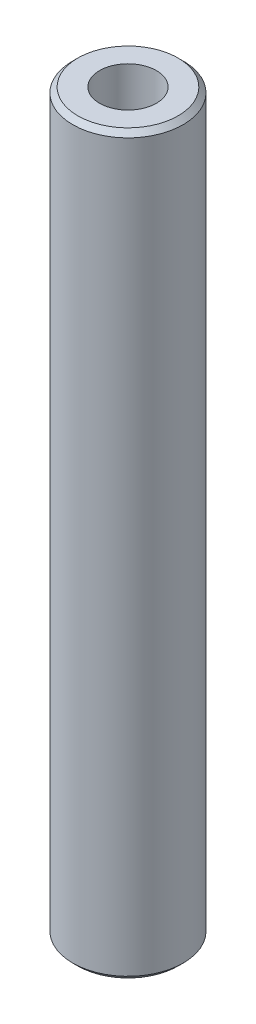
ISO-10303-21;
HEADER;
FILE_DESCRIPTION(('STEP AP214'),'2;1');
FILE_NAME('part.step','',(''),(''),'','','');
FILE_SCHEMA(('AUTOMOTIVE_DESIGN { 1 0 10303 214 1 1 1 1 }'));
ENDSEC;
DATA;
#1=APPLICATION_CONTEXT('core data for automotive mechanical design processes');
#2=APPLICATION_PROTOCOL_DEFINITION('international standard','automotive_design',2000,#1);
#3=PRODUCT_CONTEXT('',#1,'mechanical');
#4=PRODUCT('Part','Part','',(#3));
#5=PRODUCT_RELATED_PRODUCT_CATEGORY('part','',(#4));
#6=PRODUCT_DEFINITION_FORMATION('','',#4);
#7=PRODUCT_DEFINITION_CONTEXT('part definition',#1,'design');
#8=PRODUCT_DEFINITION('design','',#6,#7);
#9=PRODUCT_DEFINITION_SHAPE('','',#8);
#10=(LENGTH_UNIT() NAMED_UNIT(*) SI_UNIT(.MILLI.,.METRE.));
#11=(NAMED_UNIT(*) PLANE_ANGLE_UNIT() SI_UNIT($,.RADIAN.));
#12=(NAMED_UNIT(*) SI_UNIT($,.STERADIAN.) SOLID_ANGLE_UNIT());
#13=UNCERTAINTY_MEASURE_WITH_UNIT(LENGTH_MEASURE(1.E-05),#10,'distance_accuracy_value','');
#14=(GEOMETRIC_REPRESENTATION_CONTEXT(3) GLOBAL_UNCERTAINTY_ASSIGNED_CONTEXT((#13)) GLOBAL_UNIT_ASSIGNED_CONTEXT((#10,
#11,#12)) REPRESENTATION_CONTEXT('',''));
#15=CARTESIAN_POINT('',(0.,0.,0.));
#16=DIRECTION('',(0.,0.,1.));
#17=DIRECTION('',(1.,0.,0.));
#18=AXIS2_PLACEMENT_3D('',#15,#16,#17);
#19=CARTESIAN_POINT('',(0.,600.,0.));
#20=DIRECTION('',(0.,-1.,0.));
#21=DIRECTION('',(0.,0.,-1.));
#22=AXIS2_PLACEMENT_3D('',#19,#20,#21);
#23=CYLINDRICAL_SURFACE('',#22,45.);
#24=CARTESIAN_POINT('',(0.,595.849188709429,0.));
#25=DIRECTION('',(0.,1.,0.));
#26=DIRECTION('',(0.,0.,1.));
#27=AXIS2_PLACEMENT_3D('',#24,#25,#26);
#28=CIRCLE('',#27,45.);
#29=CARTESIAN_POINT('',(0.,595.849188709429,45.));
#30=VERTEX_POINT('',#29);
#31=EDGE_CURVE('E50',#30,#30,#28,.F.);
#32=ORIENTED_EDGE('',*,*,#31,.T.);
#33=EDGE_LOOP('',(#32));
#34=FACE_BOUND('',#33,.T.);
#35=CARTESIAN_POINT('',(0.,4.15081129057149,0.));
#36=DIRECTION('',(0.,1.,0.));
#37=DIRECTION('',(0.,0.,1.));
#38=AXIS2_PLACEMENT_3D('',#35,#36,#37);
#39=CIRCLE('',#38,45.);
#40=CARTESIAN_POINT('',(0.,4.15081129057149,45.));
#41=VERTEX_POINT('',#40);
#42=EDGE_CURVE('E51',#41,#41,#39,.T.);
#43=ORIENTED_EDGE('',*,*,#42,.T.);
#44=EDGE_LOOP('',(#43));
#45=FACE_BOUND('',#44,.T.);
#46=ADVANCED_FACE('F39',(#34,#45),#23,.T.);
#47=CARTESIAN_POINT('',(0.,600.,0.));
#48=DIRECTION('',(0.,1.,0.));
#49=DIRECTION('',(0.,0.,1.));
#50=AXIS2_PLACEMENT_3D('',#47,#48,#49);
#51=PLANE('',#50);
#52=CARTESIAN_POINT('',(0.,600.,0.));
#53=DIRECTION('',(0.,1.,0.));
#54=DIRECTION('',(0.,0.,1.));
#55=AXIS2_PLACEMENT_3D('',#52,#53,#54);
#56=CIRCLE('',#55,40.8491887094286);
#57=CARTESIAN_POINT('',(0.,600.,40.8491887094286));
#58=VERTEX_POINT('',#57);
#59=EDGE_CURVE('E54',#58,#58,#56,.T.);
#60=ORIENTED_EDGE('',*,*,#59,.T.);
#61=EDGE_LOOP('',(#60));
#62=FACE_BOUND('',#61,.T.);
#63=CARTESIAN_POINT('',(0.,600.,0.));
#64=DIRECTION('',(0.,1.,0.));
#65=DIRECTION('',(0.,0.,1.));
#66=AXIS2_PLACEMENT_3D('',#63,#64,#65);
#67=CIRCLE('',#66,23.1411107599256);
#68=CARTESIAN_POINT('',(0.,600.,23.1411107599256));
#69=VERTEX_POINT('',#68);
#70=EDGE_CURVE('E58',#69,#69,#67,.T.);
#71=ORIENTED_EDGE('',*,*,#70,.F.);
#72=EDGE_LOOP('',(#71));
#73=FACE_BOUND('',#72,.T.);
#74=ADVANCED_FACE('F69',(#62,#73),#51,.T.);
#75=CARTESIAN_POINT('',(0.,0.,0.));
#76=DIRECTION('',(0.,1.,0.));
#77=DIRECTION('',(0.,0.,1.));
#78=AXIS2_PLACEMENT_3D('',#75,#76,#77);
#79=PLANE('',#78);
#80=CARTESIAN_POINT('',(0.,0.,0.));
#81=DIRECTION('',(0.,1.,0.));
#82=DIRECTION('',(0.,0.,1.));
#83=AXIS2_PLACEMENT_3D('',#80,#81,#82);
#84=CIRCLE('',#83,40.8491887094285);
#85=CARTESIAN_POINT('',(0.,0.,40.8491887094285));
#86=VERTEX_POINT('',#85);
#87=EDGE_CURVE('E10',#86,#86,#84,.F.);
#88=ORIENTED_EDGE('',*,*,#87,.T.);
#89=EDGE_LOOP('',(#88));
#90=FACE_BOUND('',#89,.T.);
#91=CARTESIAN_POINT('',(0.,0.,0.));
#92=DIRECTION('',(0.,1.,0.));
#93=DIRECTION('',(0.,0.,1.));
#94=AXIS2_PLACEMENT_3D('',#91,#92,#93);
#95=CIRCLE('',#94,23.1411107599256);
#96=CARTESIAN_POINT('',(0.,0.,23.1411107599256));
#97=VERTEX_POINT('',#96);
#98=EDGE_CURVE('E63',#97,#97,#95,.T.);
#99=ORIENTED_EDGE('',*,*,#98,.T.);
#100=EDGE_LOOP('',(#99));
#101=FACE_BOUND('',#100,.T.);
#102=ADVANCED_FACE('F75',(#90,#101),#79,.F.);
#103=CARTESIAN_POINT('',(0.,600.,0.));
#104=DIRECTION('',(0.,-1.,0.));
#105=DIRECTION('',(0.,0.,-1.));
#106=AXIS2_PLACEMENT_3D('',#103,#104,#105);
#107=CYLINDRICAL_SURFACE('',#106,23.1411107599256);
#108=ORIENTED_EDGE('',*,*,#70,.T.);
#109=EDGE_LOOP('',(#108));
#110=FACE_BOUND('',#109,.T.);
#111=ORIENTED_EDGE('',*,*,#98,.F.);
#112=EDGE_LOOP('',(#111));
#113=FACE_BOUND('',#112,.T.);
#114=ADVANCED_FACE('F70',(#110,#113),#107,.F.);
#115=CARTESIAN_POINT('',(0.,600.,0.));
#116=DIRECTION('',(0.,-1.,0.));
#117=DIRECTION('',(0.,0.,-1.));
#118=AXIS2_PLACEMENT_3D('',#115,#116,#117);
#119=CONICAL_SURFACE('',#118,40.8491887094286,0.785398163397444);
#120=ORIENTED_EDGE('',*,*,#31,.F.);
#121=EDGE_LOOP('',(#120));
#122=FACE_BOUND('',#121,.T.);
#123=ORIENTED_EDGE('',*,*,#59,.F.);
#124=EDGE_LOOP('',(#123));
#125=FACE_BOUND('',#124,.T.);
#126=ADVANCED_FACE('F81',(#122,#125),#119,.T.);
#127=CARTESIAN_POINT('',(0.,4.15081129057149,0.));
#128=DIRECTION('',(0.,1.,0.));
#129=DIRECTION('',(0.,0.,1.));
#130=AXIS2_PLACEMENT_3D('',#127,#128,#129);
#131=CONICAL_SURFACE('',#130,45.,0.785398163397452);
#132=ORIENTED_EDGE('',*,*,#87,.F.);
#133=EDGE_LOOP('',(#132));
#134=FACE_BOUND('',#133,.T.);
#135=ORIENTED_EDGE('',*,*,#42,.F.);
#136=EDGE_LOOP('',(#135));
#137=FACE_BOUND('',#136,.T.);
#138=ADVANCED_FACE('F45',(#134,#137),#131,.T.);
#139=CLOSED_SHELL('',(#46,#74,#102,#114,#126,#138));
#140=MANIFOLD_SOLID_BREP('B2',#139);
#141=ADVANCED_BREP_SHAPE_REPRESENTATION('',(#18,#140),#14);
#142=SHAPE_DEFINITION_REPRESENTATION(#9,#141);
ENDSEC;
END-ISO-10303-21;
